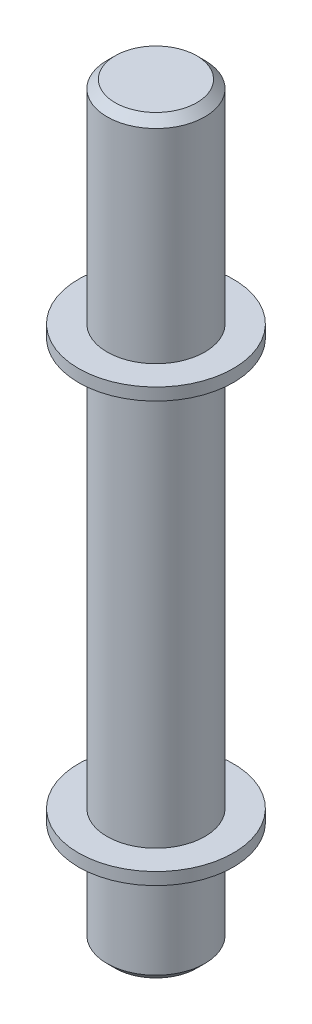
ISO-10303-21;
HEADER;
FILE_DESCRIPTION(('STEP AP214'),'2;1');
FILE_NAME('part.step','',(''),(''),'','','');
FILE_SCHEMA(('AUTOMOTIVE_DESIGN { 1 0 10303 214 1 1 1 1 }'));
ENDSEC;
DATA;
#1=APPLICATION_CONTEXT('core data for automotive mechanical design processes');
#2=APPLICATION_PROTOCOL_DEFINITION('international standard','automotive_design',2000,#1);
#3=PRODUCT_CONTEXT('',#1,'mechanical');
#4=PRODUCT('Part','Part','',(#3));
#5=PRODUCT_RELATED_PRODUCT_CATEGORY('part','',(#4));
#6=PRODUCT_DEFINITION_FORMATION('','',#4);
#7=PRODUCT_DEFINITION_CONTEXT('part definition',#1,'design');
#8=PRODUCT_DEFINITION('design','',#6,#7);
#9=PRODUCT_DEFINITION_SHAPE('','',#8);
#10=(LENGTH_UNIT() NAMED_UNIT(*) SI_UNIT(.MILLI.,.METRE.));
#11=(NAMED_UNIT(*) PLANE_ANGLE_UNIT() SI_UNIT($,.RADIAN.));
#12=(NAMED_UNIT(*) SI_UNIT($,.STERADIAN.) SOLID_ANGLE_UNIT());
#13=UNCERTAINTY_MEASURE_WITH_UNIT(LENGTH_MEASURE(1.E-05),#10,'distance_accuracy_value','');
#14=(GEOMETRIC_REPRESENTATION_CONTEXT(3) GLOBAL_UNCERTAINTY_ASSIGNED_CONTEXT((#13)) GLOBAL_UNIT_ASSIGNED_CONTEXT((#10,
#11,#12)) REPRESENTATION_CONTEXT('',''));
#15=CARTESIAN_POINT('',(0.,0.,0.));
#16=DIRECTION('',(0.,0.,1.));
#17=DIRECTION('',(1.,0.,0.));
#18=AXIS2_PLACEMENT_3D('',#15,#16,#17);
#19=CARTESIAN_POINT('',(0.,0.,0.));
#20=DIRECTION('',(0.,1.,0.));
#21=DIRECTION('',(0.,0.,1.));
#22=AXIS2_PLACEMENT_3D('',#19,#20,#21);
#23=PLANE('',#22);
#24=CARTESIAN_POINT('',(0.,0.,0.));
#25=DIRECTION('',(0.,1.,0.));
#26=DIRECTION('',(0.,0.,1.));
#27=AXIS2_PLACEMENT_3D('',#24,#25,#26);
#28=CIRCLE('',#27,10.);
#29=CARTESIAN_POINT('',(0.,0.,10.));
#30=VERTEX_POINT('',#29);
#31=EDGE_CURVE('E59',#30,#30,#28,.F.);
#32=ORIENTED_EDGE('',*,*,#31,.T.);
#33=EDGE_LOOP('',(#32));
#34=FACE_BOUND('',#33,.T.);
#35=ADVANCED_FACE('F47',(#34),#23,.F.);
#36=CARTESIAN_POINT('',(0.,184.,0.));
#37=DIRECTION('',(0.,1.,0.));
#38=DIRECTION('',(0.,0.,1.));
#39=AXIS2_PLACEMENT_3D('',#36,#37,#38);
#40=CYLINDRICAL_SURFACE('',#39,12.);
#41=CARTESIAN_POINT('',(0.,1.99999999999997,0.));
#42=DIRECTION('',(0.,1.,0.));
#43=DIRECTION('',(0.,0.,1.));
#44=AXIS2_PLACEMENT_3D('',#41,#42,#43);
#45=CIRCLE('',#44,12.);
#46=CARTESIAN_POINT('',(0.,1.99999999999997,12.));
#47=VERTEX_POINT('',#46);
#48=EDGE_CURVE('E63',#47,#47,#45,.T.);
#49=ORIENTED_EDGE('',*,*,#48,.T.);
#50=EDGE_LOOP('',(#49));
#51=FACE_BOUND('',#50,.T.);
#52=CARTESIAN_POINT('',(0.,26.,0.));
#53=DIRECTION('',(0.,1.,0.));
#54=DIRECTION('',(0.,0.,1.));
#55=AXIS2_PLACEMENT_3D('',#52,#53,#54);
#56=CIRCLE('',#55,12.);
#57=CARTESIAN_POINT('',(0.,26.,12.));
#58=VERTEX_POINT('',#57);
#59=EDGE_CURVE('E68',#58,#58,#56,.T.);
#60=ORIENTED_EDGE('',*,*,#59,.F.);
#61=EDGE_LOOP('',(#60));
#62=FACE_BOUND('',#61,.T.);
#63=ADVANCED_FACE('F134',(#51,#62),#40,.T.);
#64=CARTESIAN_POINT('',(0.,26.,-12.));
#65=DIRECTION('',(0.,1.,0.));
#66=DIRECTION('',(0.,0.,1.));
#67=AXIS2_PLACEMENT_3D('',#64,#65,#66);
#68=PLANE('',#67);
#69=CARTESIAN_POINT('',(0.,26.,0.));
#70=DIRECTION('',(0.,1.,0.));
#71=DIRECTION('',(0.,0.,1.));
#72=AXIS2_PLACEMENT_3D('',#69,#70,#71);
#73=CIRCLE('',#72,19.);
#74=CARTESIAN_POINT('',(0.,26.,19.));
#75=VERTEX_POINT('',#74);
#76=EDGE_CURVE('E71',#75,#75,#73,.T.);
#77=ORIENTED_EDGE('',*,*,#76,.F.);
#78=EDGE_LOOP('',(#77));
#79=FACE_BOUND('',#78,.T.);
#80=ORIENTED_EDGE('',*,*,#59,.T.);
#81=EDGE_LOOP('',(#80));
#82=FACE_BOUND('',#81,.T.);
#83=ADVANCED_FACE('F128',(#79,#82),#68,.F.);
#84=CARTESIAN_POINT('',(0.,184.,0.));
#85=DIRECTION('',(0.,1.,0.));
#86=DIRECTION('',(0.,0.,1.));
#87=AXIS2_PLACEMENT_3D('',#84,#85,#86);
#88=CYLINDRICAL_SURFACE('',#87,19.);
#89=CARTESIAN_POINT('',(0.,29.,0.));
#90=DIRECTION('',(0.,1.,0.));
#91=DIRECTION('',(0.,0.,1.));
#92=AXIS2_PLACEMENT_3D('',#89,#90,#91);
#93=CIRCLE('',#92,19.);
#94=CARTESIAN_POINT('',(0.,29.,19.));
#95=VERTEX_POINT('',#94);
#96=EDGE_CURVE('E74',#95,#95,#93,.T.);
#97=ORIENTED_EDGE('',*,*,#96,.F.);
#98=EDGE_LOOP('',(#97));
#99=FACE_BOUND('',#98,.T.);
#100=ORIENTED_EDGE('',*,*,#76,.T.);
#101=EDGE_LOOP('',(#100));
#102=FACE_BOUND('',#101,.T.);
#103=ADVANCED_FACE('F122',(#99,#102),#88,.T.);
#104=CARTESIAN_POINT('',(0.,29.,-19.));
#105=DIRECTION('',(0.,-1.,0.));
#106=DIRECTION('',(0.,0.,-1.));
#107=AXIS2_PLACEMENT_3D('',#104,#105,#106);
#108=PLANE('',#107);
#109=CARTESIAN_POINT('',(0.,29.,0.));
#110=DIRECTION('',(0.,1.,0.));
#111=DIRECTION('',(0.,0.,1.));
#112=AXIS2_PLACEMENT_3D('',#109,#110,#111);
#113=CIRCLE('',#112,12.);
#114=CARTESIAN_POINT('',(0.,29.,12.));
#115=VERTEX_POINT('',#114);
#116=EDGE_CURVE('E77',#115,#115,#113,.T.);
#117=ORIENTED_EDGE('',*,*,#116,.F.);
#118=EDGE_LOOP('',(#117));
#119=FACE_BOUND('',#118,.T.);
#120=ORIENTED_EDGE('',*,*,#96,.T.);
#121=EDGE_LOOP('',(#120));
#122=FACE_BOUND('',#121,.T.);
#123=ADVANCED_FACE('F116',(#119,#122),#108,.F.);
#124=CARTESIAN_POINT('',(0.,184.,0.));
#125=DIRECTION('',(0.,1.,0.));
#126=DIRECTION('',(0.,0.,1.));
#127=AXIS2_PLACEMENT_3D('',#124,#125,#126);
#128=CYLINDRICAL_SURFACE('',#127,12.);
#129=CARTESIAN_POINT('',(0.,129.,0.));
#130=DIRECTION('',(0.,1.,0.));
#131=DIRECTION('',(0.,0.,1.));
#132=AXIS2_PLACEMENT_3D('',#129,#130,#131);
#133=CIRCLE('',#132,12.);
#134=CARTESIAN_POINT('',(0.,129.,12.));
#135=VERTEX_POINT('',#134);
#136=EDGE_CURVE('E80',#135,#135,#133,.T.);
#137=ORIENTED_EDGE('',*,*,#136,.F.);
#138=EDGE_LOOP('',(#137));
#139=FACE_BOUND('',#138,.T.);
#140=ORIENTED_EDGE('',*,*,#116,.T.);
#141=EDGE_LOOP('',(#140));
#142=FACE_BOUND('',#141,.T.);
#143=ADVANCED_FACE('F110',(#139,#142),#128,.T.);
#144=CARTESIAN_POINT('',(0.,129.,-12.));
#145=DIRECTION('',(0.,1.,0.));
#146=DIRECTION('',(0.,0.,1.));
#147=AXIS2_PLACEMENT_3D('',#144,#145,#146);
#148=PLANE('',#147);
#149=CARTESIAN_POINT('',(0.,129.,0.));
#150=DIRECTION('',(0.,1.,0.));
#151=DIRECTION('',(0.,0.,1.));
#152=AXIS2_PLACEMENT_3D('',#149,#150,#151);
#153=CIRCLE('',#152,19.);
#154=CARTESIAN_POINT('',(0.,129.,19.));
#155=VERTEX_POINT('',#154);
#156=EDGE_CURVE('E83',#155,#155,#153,.T.);
#157=ORIENTED_EDGE('',*,*,#156,.F.);
#158=EDGE_LOOP('',(#157));
#159=FACE_BOUND('',#158,.T.);
#160=ORIENTED_EDGE('',*,*,#136,.T.);
#161=EDGE_LOOP('',(#160));
#162=FACE_BOUND('',#161,.T.);
#163=ADVANCED_FACE('F104',(#159,#162),#148,.F.);
#164=CARTESIAN_POINT('',(0.,184.,0.));
#165=DIRECTION('',(0.,1.,0.));
#166=DIRECTION('',(0.,0.,1.));
#167=AXIS2_PLACEMENT_3D('',#164,#165,#166);
#168=CYLINDRICAL_SURFACE('',#167,19.);
#169=CARTESIAN_POINT('',(0.,132.,0.));
#170=DIRECTION('',(0.,1.,0.));
#171=DIRECTION('',(0.,0.,1.));
#172=AXIS2_PLACEMENT_3D('',#169,#170,#171);
#173=CIRCLE('',#172,19.);
#174=CARTESIAN_POINT('',(0.,132.,19.));
#175=VERTEX_POINT('',#174);
#176=EDGE_CURVE('E86',#175,#175,#173,.T.);
#177=ORIENTED_EDGE('',*,*,#176,.F.);
#178=EDGE_LOOP('',(#177));
#179=FACE_BOUND('',#178,.T.);
#180=ORIENTED_EDGE('',*,*,#156,.T.);
#181=EDGE_LOOP('',(#180));
#182=FACE_BOUND('',#181,.T.);
#183=ADVANCED_FACE('F98',(#179,#182),#168,.T.);
#184=CARTESIAN_POINT('',(0.,132.,-19.));
#185=DIRECTION('',(0.,-1.,0.));
#186=DIRECTION('',(0.,0.,-1.));
#187=AXIS2_PLACEMENT_3D('',#184,#185,#186);
#188=PLANE('',#187);
#189=CARTESIAN_POINT('',(0.,132.,0.));
#190=DIRECTION('',(0.,1.,0.));
#191=DIRECTION('',(0.,0.,1.));
#192=AXIS2_PLACEMENT_3D('',#189,#190,#191);
#193=CIRCLE('',#192,12.);
#194=CARTESIAN_POINT('',(0.,132.,12.));
#195=VERTEX_POINT('',#194);
#196=EDGE_CURVE('E89',#195,#195,#193,.T.);
#197=ORIENTED_EDGE('',*,*,#196,.F.);
#198=EDGE_LOOP('',(#197));
#199=FACE_BOUND('',#198,.T.);
#200=ORIENTED_EDGE('',*,*,#176,.T.);
#201=EDGE_LOOP('',(#200));
#202=FACE_BOUND('',#201,.T.);
#203=ADVANCED_FACE('F95',(#199,#202),#188,.F.);
#204=CARTESIAN_POINT('',(0.,184.,0.));
#205=DIRECTION('',(0.,1.,0.));
#206=DIRECTION('',(0.,0.,1.));
#207=AXIS2_PLACEMENT_3D('',#204,#205,#206);
#208=CYLINDRICAL_SURFACE('',#207,12.);
#209=CARTESIAN_POINT('',(0.,182.,0.));
#210=DIRECTION('',(0.,-1.,0.));
#211=DIRECTION('',(0.,0.,-1.));
#212=AXIS2_PLACEMENT_3D('',#209,#210,#211);
#213=CIRCLE('',#212,12.);
#214=CARTESIAN_POINT('',(0.,182.,-12.));
#215=VERTEX_POINT('',#214);
#216=EDGE_CURVE('E10',#215,#215,#213,.T.);
#217=ORIENTED_EDGE('',*,*,#216,.T.);
#218=EDGE_LOOP('',(#217));
#219=FACE_BOUND('',#218,.T.);
#220=ORIENTED_EDGE('',*,*,#196,.T.);
#221=EDGE_LOOP('',(#220));
#222=FACE_BOUND('',#221,.T.);
#223=ADVANCED_FACE('F93',(#219,#222),#208,.T.);
#224=CARTESIAN_POINT('',(0.,184.,-12.));
#225=DIRECTION('',(0.,-1.,0.));
#226=DIRECTION('',(0.,0.,-1.));
#227=AXIS2_PLACEMENT_3D('',#224,#225,#226);
#228=PLANE('',#227);
#229=CARTESIAN_POINT('',(0.,184.,0.));
#230=DIRECTION('',(0.,-1.,0.));
#231=DIRECTION('',(0.,0.,-1.));
#232=AXIS2_PLACEMENT_3D('',#229,#230,#231);
#233=CIRCLE('',#232,9.99999999999998);
#234=CARTESIAN_POINT('',(0.,184.,-9.99999999999998));
#235=VERTEX_POINT('',#234);
#236=EDGE_CURVE('E55',#235,#235,#233,.F.);
#237=ORIENTED_EDGE('',*,*,#236,.T.);
#238=EDGE_LOOP('',(#237));
#239=FACE_BOUND('',#238,.T.);
#240=ADVANCED_FACE('F151',(#239),#228,.F.);
#241=CARTESIAN_POINT('',(0.,1.99999999999997,0.));
#242=DIRECTION('',(0.,1.,0.));
#243=DIRECTION('',(0.,0.,1.));
#244=AXIS2_PLACEMENT_3D('',#241,#242,#243);
#245=CONICAL_SURFACE('',#244,12.,0.785398163397453);
#246=ORIENTED_EDGE('',*,*,#31,.F.);
#247=EDGE_LOOP('',(#246));
#248=FACE_BOUND('',#247,.T.);
#249=ORIENTED_EDGE('',*,*,#48,.F.);
#250=EDGE_LOOP('',(#249));
#251=FACE_BOUND('',#250,.T.);
#252=ADVANCED_FACE('F147',(#248,#251),#245,.T.);
#253=CARTESIAN_POINT('',(0.,184.,0.));
#254=DIRECTION('',(0.,-1.,0.));
#255=DIRECTION('',(0.,0.,-1.));
#256=AXIS2_PLACEMENT_3D('',#253,#254,#255);
#257=CONICAL_SURFACE('',#256,9.99999999999998,0.785398163397453);
#258=ORIENTED_EDGE('',*,*,#216,.F.);
#259=EDGE_LOOP('',(#258));
#260=FACE_BOUND('',#259,.T.);
#261=ORIENTED_EDGE('',*,*,#236,.F.);
#262=EDGE_LOOP('',(#261));
#263=FACE_BOUND('',#262,.T.);
#264=ADVANCED_FACE('F50',(#260,#263),#257,.T.);
#265=CLOSED_SHELL('',(#35,#63,#83,#103,#123,#143,#163,#183,#203,#223,#240,#252,#264));
#266=MANIFOLD_SOLID_BREP('B2',#265);
#267=ADVANCED_BREP_SHAPE_REPRESENTATION('',(#18,#266),#14);
#268=SHAPE_DEFINITION_REPRESENTATION(#9,#267);
ENDSEC;
END-ISO-10303-21;
